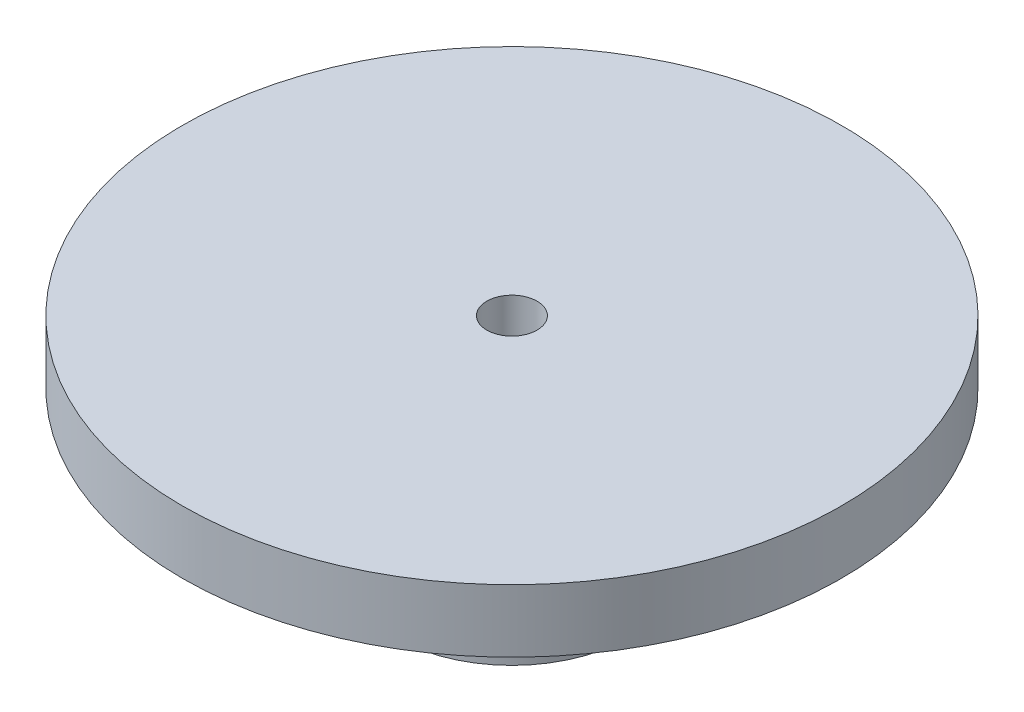
ISO-10303-21;
HEADER;
FILE_DESCRIPTION(('STEP AP214'),'2;1');
FILE_NAME('part.step','',(''),(''),'','','');
FILE_SCHEMA(('AUTOMOTIVE_DESIGN { 1 0 10303 214 1 1 1 1 }'));
ENDSEC;
DATA;
#1=APPLICATION_CONTEXT('core data for automotive mechanical design processes');
#2=APPLICATION_PROTOCOL_DEFINITION('international standard','automotive_design',2000,#1);
#3=PRODUCT_CONTEXT('',#1,'mechanical');
#4=PRODUCT('Part','Part','',(#3));
#5=PRODUCT_RELATED_PRODUCT_CATEGORY('part','',(#4));
#6=PRODUCT_DEFINITION_FORMATION('','',#4);
#7=PRODUCT_DEFINITION_CONTEXT('part definition',#1,'design');
#8=PRODUCT_DEFINITION('design','',#6,#7);
#9=PRODUCT_DEFINITION_SHAPE('','',#8);
#10=(LENGTH_UNIT() NAMED_UNIT(*) SI_UNIT(.MILLI.,.METRE.));
#11=(NAMED_UNIT(*) PLANE_ANGLE_UNIT() SI_UNIT($,.RADIAN.));
#12=(NAMED_UNIT(*) SI_UNIT($,.STERADIAN.) SOLID_ANGLE_UNIT());
#13=UNCERTAINTY_MEASURE_WITH_UNIT(LENGTH_MEASURE(1.E-05),#10,'distance_accuracy_value','');
#14=(GEOMETRIC_REPRESENTATION_CONTEXT(3) GLOBAL_UNCERTAINTY_ASSIGNED_CONTEXT((#13)) GLOBAL_UNIT_ASSIGNED_CONTEXT((#10,
#11,#12)) REPRESENTATION_CONTEXT('',''));
#15=CARTESIAN_POINT('',(0.,0.,0.));
#16=DIRECTION('',(0.,0.,1.));
#17=DIRECTION('',(1.,0.,0.));
#18=AXIS2_PLACEMENT_3D('',#15,#16,#17);
#19=CARTESIAN_POINT('',(0.,0.,0.));
#20=DIRECTION('',(0.,1.,0.));
#21=DIRECTION('',(0.,0.,1.));
#22=AXIS2_PLACEMENT_3D('',#19,#20,#21);
#23=PLANE('',#22);
#24=CARTESIAN_POINT('',(0.,0.,0.));
#25=DIRECTION('',(0.,1.,0.));
#26=DIRECTION('',(0.,0.,1.));
#27=AXIS2_PLACEMENT_3D('',#24,#25,#26);
#28=CIRCLE('',#27,3.75);
#29=CARTESIAN_POINT('',(0.,0.,3.75));
#30=VERTEX_POINT('',#29);
#31=EDGE_CURVE('E34',#30,#30,#28,.T.);
#32=ORIENTED_EDGE('',*,*,#31,.F.);
#33=EDGE_LOOP('',(#32));
#34=FACE_BOUND('',#33,.T.);
#35=CARTESIAN_POINT('',(0.,0.,0.));
#36=DIRECTION('',(0.,1.,0.));
#37=DIRECTION('',(0.,0.,1.));
#38=AXIS2_PLACEMENT_3D('',#35,#36,#37);
#39=CIRCLE('',#38,3.);
#40=CARTESIAN_POINT('',(0.,0.,3.));
#41=VERTEX_POINT('',#40);
#42=EDGE_CURVE('E41',#41,#41,#39,.T.);
#43=ORIENTED_EDGE('',*,*,#42,.T.);
#44=EDGE_LOOP('',(#43));
#45=FACE_BOUND('',#44,.T.);
#46=ADVANCED_FACE('F30',(#34,#45),#23,.F.);
#47=CARTESIAN_POINT('',(0.,5.,0.));
#48=DIRECTION('',(0.,-1.,0.));
#49=DIRECTION('',(0.,0.,-1.));
#50=AXIS2_PLACEMENT_3D('',#47,#48,#49);
#51=CYLINDRICAL_SURFACE('',#50,3.75);
#52=CARTESIAN_POINT('',(0.,5.,0.));
#53=DIRECTION('',(0.,1.,0.));
#54=DIRECTION('',(0.,0.,1.));
#55=AXIS2_PLACEMENT_3D('',#52,#53,#54);
#56=CIRCLE('',#55,3.75);
#57=CARTESIAN_POINT('',(0.,5.,3.75));
#58=VERTEX_POINT('',#57);
#59=EDGE_CURVE('E10',#58,#58,#56,.T.);
#60=ORIENTED_EDGE('',*,*,#59,.F.);
#61=EDGE_LOOP('',(#60));
#62=FACE_BOUND('',#61,.T.);
#63=ORIENTED_EDGE('',*,*,#31,.T.);
#64=EDGE_LOOP('',(#63));
#65=FACE_BOUND('',#64,.T.);
#66=ADVANCED_FACE('F32',(#62,#65),#51,.T.);
#67=CARTESIAN_POINT('',(0.,5.,0.));
#68=DIRECTION('',(0.,-1.,0.));
#69=DIRECTION('',(0.,0.,-1.));
#70=AXIS2_PLACEMENT_3D('',#67,#68,#69);
#71=CYLINDRICAL_SURFACE('',#70,3.);
#72=CARTESIAN_POINT('',(0.,5.,0.));
#73=DIRECTION('',(0.,1.,0.));
#74=DIRECTION('',(0.,0.,1.));
#75=AXIS2_PLACEMENT_3D('',#72,#73,#74);
#76=CIRCLE('',#75,3.);
#77=CARTESIAN_POINT('',(0.,5.,3.));
#78=VERTEX_POINT('',#77);
#79=EDGE_CURVE('E45',#78,#78,#76,.T.);
#80=ORIENTED_EDGE('',*,*,#79,.T.);
#81=EDGE_LOOP('',(#80));
#82=FACE_BOUND('',#81,.T.);
#83=ORIENTED_EDGE('',*,*,#42,.F.);
#84=EDGE_LOOP('',(#83));
#85=FACE_BOUND('',#84,.T.);
#86=ADVANCED_FACE('F76',(#82,#85),#71,.F.);
#87=CARTESIAN_POINT('',(0.,5.,0.));
#88=DIRECTION('',(0.,1.,0.));
#89=DIRECTION('',(0.,0.,1.));
#90=AXIS2_PLACEMENT_3D('',#87,#88,#89);
#91=PLANE('',#90);
#92=CARTESIAN_POINT('',(0.,5.,0.));
#93=DIRECTION('',(0.,1.,0.));
#94=DIRECTION('',(0.,0.,1.));
#95=AXIS2_PLACEMENT_3D('',#92,#93,#94);
#96=CIRCLE('',#95,0.800000000000007);
#97=CARTESIAN_POINT('',(0.,5.,0.800000000000007));
#98=VERTEX_POINT('',#97);
#99=EDGE_CURVE('E55',#98,#98,#96,.T.);
#100=ORIENTED_EDGE('',*,*,#99,.T.);
#101=EDGE_LOOP('',(#100));
#102=FACE_BOUND('',#101,.T.);
#103=ORIENTED_EDGE('',*,*,#79,.F.);
#104=EDGE_LOOP('',(#103));
#105=FACE_BOUND('',#104,.T.);
#106=ADVANCED_FACE('F67',(#102,#105),#91,.F.);
#107=CARTESIAN_POINT('',(0.,7.,0.));
#108=DIRECTION('',(0.,1.,0.));
#109=DIRECTION('',(0.,0.,1.));
#110=AXIS2_PLACEMENT_3D('',#107,#108,#109);
#111=PLANE('',#110);
#112=CARTESIAN_POINT('',(0.,7.,0.));
#113=DIRECTION('',(0.,1.,0.));
#114=DIRECTION('',(0.,0.,1.));
#115=AXIS2_PLACEMENT_3D('',#112,#113,#114);
#116=CIRCLE('',#115,10.5);
#117=CARTESIAN_POINT('',(0.,7.,10.5));
#118=VERTEX_POINT('',#117);
#119=EDGE_CURVE('E48',#118,#118,#116,.T.);
#120=ORIENTED_EDGE('',*,*,#119,.T.);
#121=EDGE_LOOP('',(#120));
#122=FACE_BOUND('',#121,.T.);
#123=CARTESIAN_POINT('',(0.,7.,0.));
#124=DIRECTION('',(0.,1.,0.));
#125=DIRECTION('',(0.,0.,1.));
#126=AXIS2_PLACEMENT_3D('',#123,#124,#125);
#127=CIRCLE('',#126,0.800000000000007);
#128=CARTESIAN_POINT('',(0.,7.,0.800000000000007));
#129=VERTEX_POINT('',#128);
#130=EDGE_CURVE('E52',#129,#129,#127,.T.);
#131=ORIENTED_EDGE('',*,*,#130,.F.);
#132=EDGE_LOOP('',(#131));
#133=FACE_BOUND('',#132,.T.);
#134=ADVANCED_FACE('F64',(#122,#133),#111,.T.);
#135=ORIENTED_EDGE('',*,*,#59,.T.);
#136=EDGE_LOOP('',(#135));
#137=FACE_BOUND('',#136,.T.);
#138=CARTESIAN_POINT('',(0.,5.,0.));
#139=DIRECTION('',(0.,1.,0.));
#140=DIRECTION('',(0.,0.,1.));
#141=AXIS2_PLACEMENT_3D('',#138,#139,#140);
#142=CIRCLE('',#141,10.5);
#143=CARTESIAN_POINT('',(0.,5.,10.5));
#144=VERTEX_POINT('',#143);
#145=EDGE_CURVE('E49',#144,#144,#142,.T.);
#146=ORIENTED_EDGE('',*,*,#145,.F.);
#147=EDGE_LOOP('',(#146));
#148=FACE_BOUND('',#147,.T.);
#149=ADVANCED_FACE('F66',(#137,#148),#91,.F.);
#150=CARTESIAN_POINT('',(0.,7.,0.));
#151=DIRECTION('',(0.,-1.,0.));
#152=DIRECTION('',(0.,0.,-1.));
#153=AXIS2_PLACEMENT_3D('',#150,#151,#152);
#154=CYLINDRICAL_SURFACE('',#153,10.5);
#155=ORIENTED_EDGE('',*,*,#119,.F.);
#156=EDGE_LOOP('',(#155));
#157=FACE_BOUND('',#156,.T.);
#158=ORIENTED_EDGE('',*,*,#145,.T.);
#159=EDGE_LOOP('',(#158));
#160=FACE_BOUND('',#159,.T.);
#161=ADVANCED_FACE('F74',(#157,#160),#154,.T.);
#162=CARTESIAN_POINT('',(0.,7.,0.));
#163=DIRECTION('',(0.,-1.,0.));
#164=DIRECTION('',(0.,0.,-1.));
#165=AXIS2_PLACEMENT_3D('',#162,#163,#164);
#166=CYLINDRICAL_SURFACE('',#165,0.800000000000007);
#167=ORIENTED_EDGE('',*,*,#130,.T.);
#168=EDGE_LOOP('',(#167));
#169=FACE_BOUND('',#168,.T.);
#170=ORIENTED_EDGE('',*,*,#99,.F.);
#171=EDGE_LOOP('',(#170));
#172=FACE_BOUND('',#171,.T.);
#173=ADVANCED_FACE('F61',(#169,#172),#166,.F.);
#174=CLOSED_SHELL('',(#46,#66,#86,#106,#134,#149,#161,#173));
#175=MANIFOLD_SOLID_BREP('B2',#174);
#176=ADVANCED_BREP_SHAPE_REPRESENTATION('',(#18,#175),#14);
#177=SHAPE_DEFINITION_REPRESENTATION(#9,#176);
ENDSEC;
END-ISO-10303-21;
